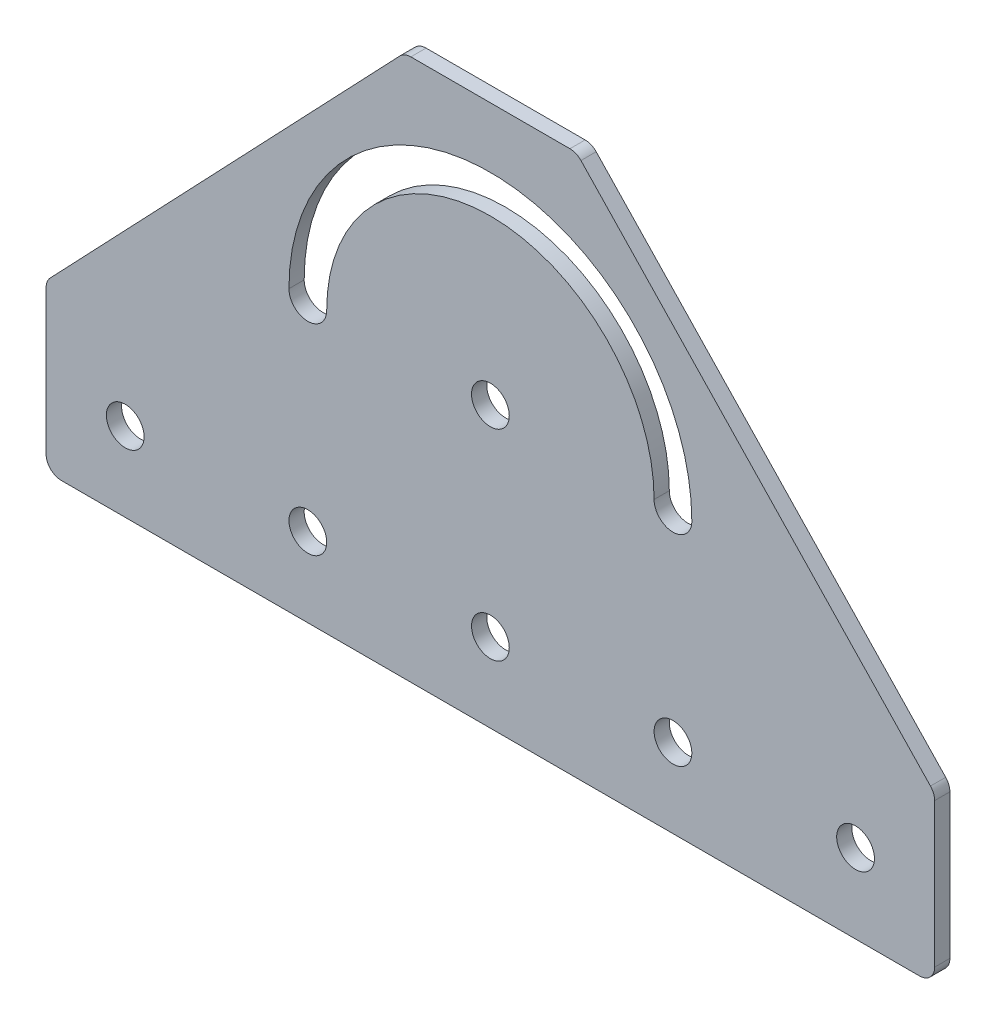
ISO-10303-21;
HEADER;
FILE_DESCRIPTION(('STEP AP214'),'2;1');
FILE_NAME('part.step','',(''),(''),'','','');
FILE_SCHEMA(('AUTOMOTIVE_DESIGN { 1 0 10303 214 1 1 1 1 }'));
ENDSEC;
DATA;
#1=APPLICATION_CONTEXT('core data for automotive mechanical design processes');
#2=APPLICATION_PROTOCOL_DEFINITION('international standard','automotive_design',2000,#1);
#3=PRODUCT_CONTEXT('',#1,'mechanical');
#4=PRODUCT('Part','Part','',(#3));
#5=PRODUCT_RELATED_PRODUCT_CATEGORY('part','',(#4));
#6=PRODUCT_DEFINITION_FORMATION('','',#4);
#7=PRODUCT_DEFINITION_CONTEXT('part definition',#1,'design');
#8=PRODUCT_DEFINITION('design','',#6,#7);
#9=PRODUCT_DEFINITION_SHAPE('','',#8);
#10=(LENGTH_UNIT() NAMED_UNIT(*) SI_UNIT(.MILLI.,.METRE.));
#11=(NAMED_UNIT(*) PLANE_ANGLE_UNIT() SI_UNIT($,.RADIAN.));
#12=(NAMED_UNIT(*) SI_UNIT($,.STERADIAN.) SOLID_ANGLE_UNIT());
#13=UNCERTAINTY_MEASURE_WITH_UNIT(LENGTH_MEASURE(1.E-05),#10,'distance_accuracy_value','');
#14=(GEOMETRIC_REPRESENTATION_CONTEXT(3) GLOBAL_UNCERTAINTY_ASSIGNED_CONTEXT((#13)) GLOBAL_UNIT_ASSIGNED_CONTEXT((#10,
#11,#12)) REPRESENTATION_CONTEXT('',''));
#15=CARTESIAN_POINT('',(0.,0.,0.));
#16=DIRECTION('',(0.,0.,1.));
#17=DIRECTION('',(1.,0.,0.));
#18=AXIS2_PLACEMENT_3D('',#15,#16,#17);
#19=CARTESIAN_POINT('',(0.,0.,2.5));
#20=DIRECTION('',(0.,0.,1.));
#21=DIRECTION('',(1.,0.,0.));
#22=AXIS2_PLACEMENT_3D('',#19,#20,#21);
#23=PLANE('',#22);
#24=CARTESIAN_POINT('',(0.,47.9999999999996,2.5));
#25=DIRECTION('',(0.,0.,1.));
#26=DIRECTION('',(1.,0.,0.));
#27=AXIS2_PLACEMENT_3D('',#24,#25,#26);
#28=CIRCLE('',#27,3.1);
#29=CARTESIAN_POINT('',(3.1,47.9999999999996,2.5));
#30=VERTEX_POINT('',#29);
#31=EDGE_CURVE('E253',#30,#30,#28,.T.);
#32=ORIENTED_EDGE('',*,*,#31,.F.);
#33=EDGE_LOOP('',(#32));
#34=FACE_BOUND('',#33,.T.);
#35=CARTESIAN_POINT('',(-30.,14.9999999999994,2.5));
#36=DIRECTION('',(0.,0.,1.));
#37=DIRECTION('',(1.,0.,0.));
#38=AXIS2_PLACEMENT_3D('',#35,#36,#37);
#39=CIRCLE('',#38,3.1);
#40=CARTESIAN_POINT('',(-26.9,14.9999999999994,2.5));
#41=VERTEX_POINT('',#40);
#42=EDGE_CURVE('E267',#41,#41,#39,.T.);
#43=ORIENTED_EDGE('',*,*,#42,.F.);
#44=EDGE_LOOP('',(#43));
#45=FACE_BOUND('',#44,.T.);
#46=CARTESIAN_POINT('',(30.,14.9999999999999,2.5));
#47=DIRECTION('',(0.,0.,1.));
#48=DIRECTION('',(1.,0.,0.));
#49=AXIS2_PLACEMENT_3D('',#46,#47,#48);
#50=CIRCLE('',#49,3.1);
#51=CARTESIAN_POINT('',(33.1,14.9999999999999,2.5));
#52=VERTEX_POINT('',#51);
#53=EDGE_CURVE('E163',#52,#52,#50,.T.);
#54=ORIENTED_EDGE('',*,*,#53,.F.);
#55=EDGE_LOOP('',(#54));
#56=FACE_BOUND('',#55,.T.);
#57=CARTESIAN_POINT('',(60.,15.,2.5));
#58=DIRECTION('',(0.,0.,1.));
#59=DIRECTION('',(1.,0.,0.));
#60=AXIS2_PLACEMENT_3D('',#57,#58,#59);
#61=CIRCLE('',#60,3.1);
#62=CARTESIAN_POINT('',(63.1,15.,2.5));
#63=VERTEX_POINT('',#62);
#64=EDGE_CURVE('E174',#63,#63,#61,.T.);
#65=ORIENTED_EDGE('',*,*,#64,.F.);
#66=EDGE_LOOP('',(#65));
#67=FACE_BOUND('',#66,.T.);
#68=CARTESIAN_POINT('',(0.,47.9999999999996,2.5));
#69=DIRECTION('',(0.,0.,1.));
#70=DIRECTION('',(1.,0.,0.));
#71=AXIS2_PLACEMENT_3D('',#68,#69,#70);
#72=CIRCLE('',#71,33.1);
#73=CARTESIAN_POINT('',(33.1,47.9999999999996,2.5));
#74=VERTEX_POINT('',#73);
#75=CARTESIAN_POINT('',(-33.1,47.9999999999996,2.5));
#76=VERTEX_POINT('',#75);
#77=EDGE_CURVE('E140',#74,#76,#72,.T.);
#78=ORIENTED_EDGE('',*,*,#77,.F.);
#79=CARTESIAN_POINT('',(30.,47.9999999999996,2.5));
#80=DIRECTION('',(0.,0.,1.));
#81=DIRECTION('',(1.,0.,0.));
#82=AXIS2_PLACEMENT_3D('',#79,#80,#81);
#83=CIRCLE('',#82,3.1);
#84=CARTESIAN_POINT('',(26.9,47.9999999999996,2.5));
#85=VERTEX_POINT('',#84);
#86=EDGE_CURVE('E130',#85,#74,#83,.T.);
#87=ORIENTED_EDGE('',*,*,#86,.F.);
#88=CARTESIAN_POINT('',(0.,47.9999999999996,2.5));
#89=DIRECTION('',(0.,0.,-1.));
#90=DIRECTION('',(1.,0.,0.));
#91=AXIS2_PLACEMENT_3D('',#88,#89,#90);
#92=CIRCLE('',#91,26.9);
#93=CARTESIAN_POINT('',(-26.9,47.9999999999996,2.5));
#94=VERTEX_POINT('',#93);
#95=EDGE_CURVE('E156',#94,#85,#92,.T.);
#96=ORIENTED_EDGE('',*,*,#95,.F.);
#97=CARTESIAN_POINT('',(-30.,47.9999999999996,2.5));
#98=DIRECTION('',(0.,0.,1.));
#99=DIRECTION('',(1.,0.,0.));
#100=AXIS2_PLACEMENT_3D('',#97,#98,#99);
#101=CIRCLE('',#100,3.1);
#102=EDGE_CURVE('E154',#76,#94,#101,.T.);
#103=ORIENTED_EDGE('',*,*,#102,.F.);
#104=EDGE_LOOP('',(#78,#87,#96,#103));
#105=FACE_BOUND('',#104,.T.);
#106=CARTESIAN_POINT('',(0.,14.9999999999996,2.5));
#107=DIRECTION('',(0.,0.,1.));
#108=DIRECTION('',(1.,0.,0.));
#109=AXIS2_PLACEMENT_3D('',#106,#107,#108);
#110=CIRCLE('',#109,3.1);
#111=CARTESIAN_POINT('',(3.1,14.9999999999996,2.5));
#112=VERTEX_POINT('',#111);
#113=EDGE_CURVE('E273',#112,#112,#110,.T.);
#114=ORIENTED_EDGE('',*,*,#113,.F.);
#115=EDGE_LOOP('',(#114));
#116=FACE_BOUND('',#115,.T.);
#117=CARTESIAN_POINT('',(-60.,14.9999999999992,2.5));
#118=DIRECTION('',(0.,0.,1.));
#119=DIRECTION('',(1.,0.,0.));
#120=AXIS2_PLACEMENT_3D('',#117,#118,#119);
#121=CIRCLE('',#120,3.1);
#122=CARTESIAN_POINT('',(-56.9,14.9999999999992,2.5));
#123=VERTEX_POINT('',#122);
#124=EDGE_CURVE('E261',#123,#123,#121,.T.);
#125=ORIENTED_EDGE('',*,*,#124,.F.);
#126=EDGE_LOOP('',(#125));
#127=FACE_BOUND('',#126,.T.);
#128=DIRECTION('',(0.,1.,0.));
#129=VECTOR('',#128,1.);
#130=CARTESIAN_POINT('',(73.,2.00000000000001,2.5));
#131=LINE('',#130,#129);
#132=CARTESIAN_POINT('',(73.,4.50000000000001,2.5));
#133=VERTEX_POINT('',#132);
#134=CARTESIAN_POINT('',(73.,28.2,2.5));
#135=VERTEX_POINT('',#134);
#136=EDGE_CURVE('E243',#133,#135,#131,.T.);
#137=ORIENTED_EDGE('',*,*,#136,.T.);
#138=CARTESIAN_POINT('',(70.5,28.2,2.5));
#139=DIRECTION('',(0.,0.,1.));
#140=DIRECTION('',(1.,0.,0.));
#141=AXIS2_PLACEMENT_3D('',#138,#139,#140);
#142=CIRCLE('',#141,2.5);
#143=CARTESIAN_POINT('',(72.3103448275862,29.9241379310345,2.5));
#144=VERTEX_POINT('',#143);
#145=EDGE_CURVE('E194',#135,#144,#142,.T.);
#146=ORIENTED_EDGE('',*,*,#145,.T.);
#147=DIRECTION('',(-0.689655172413796,0.72413793103448,0.));
#148=VECTOR('',#147,1.);
#149=CARTESIAN_POINT('',(73.,29.2,2.5));
#150=LINE('',#149,#148);
#151=CARTESIAN_POINT('',(14.8817733990148,90.224137931034,2.5));
#152=VERTEX_POINT('',#151);
#153=EDGE_CURVE('E239',#144,#152,#150,.T.);
#154=ORIENTED_EDGE('',*,*,#153,.T.);
#155=CARTESIAN_POINT('',(13.0714285714286,88.4999999999995,2.5));
#156=DIRECTION('',(0.,0.,1.));
#157=DIRECTION('',(1.,0.,0.));
#158=AXIS2_PLACEMENT_3D('',#155,#156,#157);
#159=CIRCLE('',#158,2.5);
#160=CARTESIAN_POINT('',(13.0714285714286,90.9999999999995,2.5));
#161=VERTEX_POINT('',#160);
#162=EDGE_CURVE('E186',#152,#161,#159,.T.);
#163=ORIENTED_EDGE('',*,*,#162,.T.);
#164=DIRECTION('',(-1.,0.,0.));
#165=VECTOR('',#164,1.);
#166=CARTESIAN_POINT('',(14.1428571428571,90.9999999999995,2.5));
#167=LINE('',#166,#165);
#168=CARTESIAN_POINT('',(-13.0714285714286,90.9999999999995,2.5));
#169=VERTEX_POINT('',#168);
#170=EDGE_CURVE('E230',#161,#169,#167,.T.);
#171=ORIENTED_EDGE('',*,*,#170,.T.);
#172=CARTESIAN_POINT('',(-13.0714285714286,88.4999999999995,2.5));
#173=DIRECTION('',(0.,0.,1.));
#174=DIRECTION('',(1.,0.,0.));
#175=AXIS2_PLACEMENT_3D('',#172,#173,#174);
#176=CIRCLE('',#175,2.5);
#177=CARTESIAN_POINT('',(-14.8817733990148,90.224137931034,2.5));
#178=VERTEX_POINT('',#177);
#179=EDGE_CURVE('E184',#169,#178,#176,.T.);
#180=ORIENTED_EDGE('',*,*,#179,.T.);
#181=DIRECTION('',(-0.689655172413796,-0.72413793103448,0.));
#182=VECTOR('',#181,1.);
#183=CARTESIAN_POINT('',(-14.1428571428572,90.9999999999995,2.5));
#184=LINE('',#183,#182);
#185=CARTESIAN_POINT('',(-72.3103448275861,29.9241379310345,2.5));
#186=VERTEX_POINT('',#185);
#187=EDGE_CURVE('E238',#178,#186,#184,.T.);
#188=ORIENTED_EDGE('',*,*,#187,.T.);
#189=CARTESIAN_POINT('',(-70.5,28.2,2.5));
#190=DIRECTION('',(0.,0.,1.));
#191=DIRECTION('',(1.,0.,0.));
#192=AXIS2_PLACEMENT_3D('',#189,#190,#191);
#193=CIRCLE('',#192,2.5);
#194=CARTESIAN_POINT('',(-73.,28.2,2.5));
#195=VERTEX_POINT('',#194);
#196=EDGE_CURVE('E188',#186,#195,#193,.T.);
#197=ORIENTED_EDGE('',*,*,#196,.T.);
#198=DIRECTION('',(0.,-1.,0.));
#199=VECTOR('',#198,1.);
#200=CARTESIAN_POINT('',(-73.,29.2,2.5));
#201=LINE('',#200,#199);
#202=CARTESIAN_POINT('',(-73.,4.5,2.5));
#203=VERTEX_POINT('',#202);
#204=EDGE_CURVE('E241',#195,#203,#201,.T.);
#205=ORIENTED_EDGE('',*,*,#204,.T.);
#206=CARTESIAN_POINT('',(-70.5,4.5,2.5));
#207=DIRECTION('',(0.,0.,1.));
#208=DIRECTION('',(1.,0.,0.));
#209=AXIS2_PLACEMENT_3D('',#206,#207,#208);
#210=CIRCLE('',#209,2.5);
#211=CARTESIAN_POINT('',(-70.5,2.,2.5));
#212=VERTEX_POINT('',#211);
#213=EDGE_CURVE('E190',#203,#212,#210,.T.);
#214=ORIENTED_EDGE('',*,*,#213,.T.);
#215=DIRECTION('',(1.,0.,0.));
#216=VECTOR('',#215,1.);
#217=CARTESIAN_POINT('',(-73.,2.,2.5));
#218=LINE('',#217,#216);
#219=CARTESIAN_POINT('',(70.5,2.00000000000001,2.5));
#220=VERTEX_POINT('',#219);
#221=EDGE_CURVE('E249',#212,#220,#218,.T.);
#222=ORIENTED_EDGE('',*,*,#221,.T.);
#223=CARTESIAN_POINT('',(70.5,4.50000000000001,2.5));
#224=DIRECTION('',(0.,0.,1.));
#225=DIRECTION('',(1.,0.,0.));
#226=AXIS2_PLACEMENT_3D('',#223,#224,#225);
#227=CIRCLE('',#226,2.5);
#228=EDGE_CURVE('E192',#220,#133,#227,.T.);
#229=ORIENTED_EDGE('',*,*,#228,.T.);
#230=EDGE_LOOP('',(#137,#146,#154,#163,#171,#180,#188,#197,#205,#214,#222,#229));
#231=FACE_BOUND('',#230,.T.);
#232=ADVANCED_FACE('F16',(#34,#45,#56,#67,#105,#116,#127,#231),#23,.T.);
#233=CARTESIAN_POINT('',(0.,0.,0.));
#234=DIRECTION('',(0.,0.,1.));
#235=DIRECTION('',(1.,0.,0.));
#236=AXIS2_PLACEMENT_3D('',#233,#234,#235);
#237=PLANE('',#236);
#238=CARTESIAN_POINT('',(0.,47.9999999999996,0.));
#239=DIRECTION('',(0.,0.,1.));
#240=DIRECTION('',(1.,0.,0.));
#241=AXIS2_PLACEMENT_3D('',#238,#239,#240);
#242=CIRCLE('',#241,3.1);
#243=CARTESIAN_POINT('',(3.1,47.9999999999996,0.));
#244=VERTEX_POINT('',#243);
#245=EDGE_CURVE('E257',#244,#244,#242,.T.);
#246=ORIENTED_EDGE('',*,*,#245,.T.);
#247=EDGE_LOOP('',(#246));
#248=FACE_BOUND('',#247,.T.);
#249=CARTESIAN_POINT('',(-60.,14.9999999999992,0.));
#250=DIRECTION('',(0.,0.,1.));
#251=DIRECTION('',(1.,0.,0.));
#252=AXIS2_PLACEMENT_3D('',#249,#250,#251);
#253=CIRCLE('',#252,3.1);
#254=CARTESIAN_POINT('',(-56.9,14.9999999999992,0.));
#255=VERTEX_POINT('',#254);
#256=EDGE_CURVE('E256',#255,#255,#253,.T.);
#257=ORIENTED_EDGE('',*,*,#256,.T.);
#258=EDGE_LOOP('',(#257));
#259=FACE_BOUND('',#258,.T.);
#260=CARTESIAN_POINT('',(-30.,14.9999999999994,0.));
#261=DIRECTION('',(0.,0.,1.));
#262=DIRECTION('',(1.,0.,0.));
#263=AXIS2_PLACEMENT_3D('',#260,#261,#262);
#264=CIRCLE('',#263,3.1);
#265=CARTESIAN_POINT('',(-26.9,14.9999999999994,0.));
#266=VERTEX_POINT('',#265);
#267=EDGE_CURVE('E264',#266,#266,#264,.T.);
#268=ORIENTED_EDGE('',*,*,#267,.T.);
#269=EDGE_LOOP('',(#268));
#270=FACE_BOUND('',#269,.T.);
#271=CARTESIAN_POINT('',(0.,14.9999999999996,0.));
#272=DIRECTION('',(0.,0.,1.));
#273=DIRECTION('',(1.,0.,0.));
#274=AXIS2_PLACEMENT_3D('',#271,#272,#273);
#275=CIRCLE('',#274,3.1);
#276=CARTESIAN_POINT('',(3.1,14.9999999999996,0.));
#277=VERTEX_POINT('',#276);
#278=EDGE_CURVE('E270',#277,#277,#275,.T.);
#279=ORIENTED_EDGE('',*,*,#278,.T.);
#280=EDGE_LOOP('',(#279));
#281=FACE_BOUND('',#280,.T.);
#282=CARTESIAN_POINT('',(30.,14.9999999999999,0.));
#283=DIRECTION('',(0.,0.,1.));
#284=DIRECTION('',(1.,0.,0.));
#285=AXIS2_PLACEMENT_3D('',#282,#283,#284);
#286=CIRCLE('',#285,3.1);
#287=CARTESIAN_POINT('',(33.1,14.9999999999999,0.));
#288=VERTEX_POINT('',#287);
#289=EDGE_CURVE('E276',#288,#288,#286,.T.);
#290=ORIENTED_EDGE('',*,*,#289,.T.);
#291=EDGE_LOOP('',(#290));
#292=FACE_BOUND('',#291,.T.);
#293=CARTESIAN_POINT('',(30.,47.9999999999996,0.));
#294=DIRECTION('',(0.,0.,1.));
#295=DIRECTION('',(1.,0.,0.));
#296=AXIS2_PLACEMENT_3D('',#293,#294,#295);
#297=CIRCLE('',#296,3.1);
#298=CARTESIAN_POINT('',(26.9,47.9999999999996,0.));
#299=VERTEX_POINT('',#298);
#300=CARTESIAN_POINT('',(33.1,47.9999999999996,0.));
#301=VERTEX_POINT('',#300);
#302=EDGE_CURVE('E161',#299,#301,#297,.T.);
#303=ORIENTED_EDGE('',*,*,#302,.T.);
#304=CARTESIAN_POINT('',(0.,47.9999999999996,0.));
#305=DIRECTION('',(0.,0.,1.));
#306=DIRECTION('',(1.,0.,0.));
#307=AXIS2_PLACEMENT_3D('',#304,#305,#306);
#308=CIRCLE('',#307,33.1);
#309=CARTESIAN_POINT('',(-33.1,47.9999999999996,0.));
#310=VERTEX_POINT('',#309);
#311=EDGE_CURVE('E147',#301,#310,#308,.T.);
#312=ORIENTED_EDGE('',*,*,#311,.T.);
#313=CARTESIAN_POINT('',(-30.,47.9999999999996,0.));
#314=DIRECTION('',(0.,0.,1.));
#315=DIRECTION('',(1.,0.,0.));
#316=AXIS2_PLACEMENT_3D('',#313,#314,#315);
#317=CIRCLE('',#316,3.1);
#318=CARTESIAN_POINT('',(-26.9,47.9999999999996,0.));
#319=VERTEX_POINT('',#318);
#320=EDGE_CURVE('E165',#310,#319,#317,.T.);
#321=ORIENTED_EDGE('',*,*,#320,.T.);
#322=CARTESIAN_POINT('',(0.,47.9999999999996,0.));
#323=DIRECTION('',(0.,0.,-1.));
#324=DIRECTION('',(1.,0.,0.));
#325=AXIS2_PLACEMENT_3D('',#322,#323,#324);
#326=CIRCLE('',#325,26.9);
#327=EDGE_CURVE('E141',#319,#299,#326,.T.);
#328=ORIENTED_EDGE('',*,*,#327,.T.);
#329=EDGE_LOOP('',(#303,#312,#321,#328));
#330=FACE_BOUND('',#329,.T.);
#331=CARTESIAN_POINT('',(60.,15.,0.));
#332=DIRECTION('',(0.,0.,1.));
#333=DIRECTION('',(1.,0.,0.));
#334=AXIS2_PLACEMENT_3D('',#331,#332,#333);
#335=CIRCLE('',#334,3.1);
#336=CARTESIAN_POINT('',(63.1,15.,0.));
#337=VERTEX_POINT('',#336);
#338=EDGE_CURVE('E148',#337,#337,#335,.T.);
#339=ORIENTED_EDGE('',*,*,#338,.T.);
#340=EDGE_LOOP('',(#339));
#341=FACE_BOUND('',#340,.T.);
#342=DIRECTION('',(-0.689655172413796,0.72413793103448,0.));
#343=VECTOR('',#342,1.);
#344=CARTESIAN_POINT('',(73.,29.2,0.));
#345=LINE('',#344,#343);
#346=CARTESIAN_POINT('',(72.3103448275862,29.9241379310345,0.));
#347=VERTEX_POINT('',#346);
#348=CARTESIAN_POINT('',(14.8817733990148,90.224137931034,0.));
#349=VERTEX_POINT('',#348);
#350=EDGE_CURVE('E343',#347,#349,#345,.T.);
#351=ORIENTED_EDGE('',*,*,#350,.F.);
#352=CARTESIAN_POINT('',(70.5,28.2,0.));
#353=DIRECTION('',(0.,0.,1.));
#354=DIRECTION('',(1.,0.,0.));
#355=AXIS2_PLACEMENT_3D('',#352,#353,#354);
#356=CIRCLE('',#355,2.5);
#357=CARTESIAN_POINT('',(73.,28.2,0.));
#358=VERTEX_POINT('',#357);
#359=EDGE_CURVE('E210',#347,#358,#356,.F.);
#360=ORIENTED_EDGE('',*,*,#359,.T.);
#361=DIRECTION('',(0.,1.,0.));
#362=VECTOR('',#361,1.);
#363=CARTESIAN_POINT('',(73.,2.00000000000001,0.));
#364=LINE('',#363,#362);
#365=CARTESIAN_POINT('',(73.,4.50000000000001,0.));
#366=VERTEX_POINT('',#365);
#367=EDGE_CURVE('E252',#366,#358,#364,.T.);
#368=ORIENTED_EDGE('',*,*,#367,.F.);
#369=CARTESIAN_POINT('',(70.5,4.50000000000001,0.));
#370=DIRECTION('',(0.,0.,1.));
#371=DIRECTION('',(1.,0.,0.));
#372=AXIS2_PLACEMENT_3D('',#369,#370,#371);
#373=CIRCLE('',#372,2.5);
#374=CARTESIAN_POINT('',(70.5,2.00000000000001,0.));
#375=VERTEX_POINT('',#374);
#376=EDGE_CURVE('E208',#366,#375,#373,.F.);
#377=ORIENTED_EDGE('',*,*,#376,.T.);
#378=DIRECTION('',(1.,0.,0.));
#379=VECTOR('',#378,1.);
#380=CARTESIAN_POINT('',(-73.,2.,0.));
#381=LINE('',#380,#379);
#382=CARTESIAN_POINT('',(-70.5,2.,0.));
#383=VERTEX_POINT('',#382);
#384=EDGE_CURVE('E260',#383,#375,#381,.T.);
#385=ORIENTED_EDGE('',*,*,#384,.F.);
#386=CARTESIAN_POINT('',(-70.5,4.5,0.));
#387=DIRECTION('',(0.,0.,1.));
#388=DIRECTION('',(1.,0.,0.));
#389=AXIS2_PLACEMENT_3D('',#386,#387,#388);
#390=CIRCLE('',#389,2.5);
#391=CARTESIAN_POINT('',(-73.,4.5,0.));
#392=VERTEX_POINT('',#391);
#393=EDGE_CURVE('E206',#383,#392,#390,.F.);
#394=ORIENTED_EDGE('',*,*,#393,.T.);
#395=DIRECTION('',(0.,-1.,0.));
#396=VECTOR('',#395,1.);
#397=CARTESIAN_POINT('',(-73.,29.2,0.));
#398=LINE('',#397,#396);
#399=CARTESIAN_POINT('',(-73.,28.2,0.));
#400=VERTEX_POINT('',#399);
#401=EDGE_CURVE('E356',#400,#392,#398,.T.);
#402=ORIENTED_EDGE('',*,*,#401,.F.);
#403=CARTESIAN_POINT('',(-70.5,28.2,0.));
#404=DIRECTION('',(0.,0.,1.));
#405=DIRECTION('',(1.,0.,0.));
#406=AXIS2_PLACEMENT_3D('',#403,#404,#405);
#407=CIRCLE('',#406,2.5);
#408=CARTESIAN_POINT('',(-72.3103448275861,29.9241379310345,0.));
#409=VERTEX_POINT('',#408);
#410=EDGE_CURVE('E204',#400,#409,#407,.F.);
#411=ORIENTED_EDGE('',*,*,#410,.T.);
#412=DIRECTION('',(-0.689655172413796,-0.72413793103448,0.));
#413=VECTOR('',#412,1.);
#414=CARTESIAN_POINT('',(-14.1428571428572,90.9999999999995,0.));
#415=LINE('',#414,#413);
#416=CARTESIAN_POINT('',(-14.8817733990148,90.224137931034,0.));
#417=VERTEX_POINT('',#416);
#418=EDGE_CURVE('E349',#417,#409,#415,.T.);
#419=ORIENTED_EDGE('',*,*,#418,.F.);
#420=CARTESIAN_POINT('',(-13.0714285714286,88.4999999999995,0.));
#421=DIRECTION('',(0.,0.,1.));
#422=DIRECTION('',(1.,0.,0.));
#423=AXIS2_PLACEMENT_3D('',#420,#421,#422);
#424=CIRCLE('',#423,2.5);
#425=CARTESIAN_POINT('',(-13.0714285714286,90.9999999999995,0.));
#426=VERTEX_POINT('',#425);
#427=EDGE_CURVE('E31',#417,#426,#424,.F.);
#428=ORIENTED_EDGE('',*,*,#427,.T.);
#429=DIRECTION('',(-1.,0.,0.));
#430=VECTOR('',#429,1.);
#431=CARTESIAN_POINT('',(14.1428571428571,90.9999999999995,0.));
#432=LINE('',#431,#430);
#433=CARTESIAN_POINT('',(13.0714285714286,90.9999999999995,0.));
#434=VERTEX_POINT('',#433);
#435=EDGE_CURVE('E231',#434,#426,#432,.T.);
#436=ORIENTED_EDGE('',*,*,#435,.F.);
#437=CARTESIAN_POINT('',(13.0714285714286,88.4999999999995,0.));
#438=DIRECTION('',(0.,0.,1.));
#439=DIRECTION('',(1.,0.,0.));
#440=AXIS2_PLACEMENT_3D('',#437,#438,#439);
#441=CIRCLE('',#440,2.5);
#442=EDGE_CURVE('E202',#434,#349,#441,.F.);
#443=ORIENTED_EDGE('',*,*,#442,.T.);
#444=EDGE_LOOP('',(#351,#360,#368,#377,#385,#394,#402,#411,#419,#428,#436,#443));
#445=FACE_BOUND('',#444,.T.);
#446=ADVANCED_FACE('F283',(#248,#259,#270,#281,#292,#330,#341,#445),#237,.F.);
#447=CARTESIAN_POINT('',(60.,15.,2.5));
#448=DIRECTION('',(0.,0.,-1.));
#449=DIRECTION('',(-1.,0.,0.));
#450=AXIS2_PLACEMENT_3D('',#447,#448,#449);
#451=CYLINDRICAL_SURFACE('',#450,3.1);
#452=ORIENTED_EDGE('',*,*,#64,.T.);
#453=EDGE_LOOP('',(#452));
#454=FACE_BOUND('',#453,.T.);
#455=ORIENTED_EDGE('',*,*,#338,.F.);
#456=EDGE_LOOP('',(#455));
#457=FACE_BOUND('',#456,.T.);
#458=ADVANCED_FACE('F309',(#454,#457),#451,.F.);
#459=CARTESIAN_POINT('',(30.,47.9999999999996,2.5));
#460=DIRECTION('',(0.,0.,-1.));
#461=DIRECTION('',(-1.,0.,0.));
#462=AXIS2_PLACEMENT_3D('',#459,#460,#461);
#463=CYLINDRICAL_SURFACE('',#462,3.1);
#464=ORIENTED_EDGE('',*,*,#302,.F.);
#465=DIRECTION('',(0.,0.,-1.));
#466=VECTOR('',#465,1.);
#467=CARTESIAN_POINT('',(26.9,47.9999999999996,2.5));
#468=LINE('',#467,#466);
#469=EDGE_CURVE('E136',#85,#299,#468,.T.);
#470=ORIENTED_EDGE('',*,*,#469,.F.);
#471=ORIENTED_EDGE('',*,*,#86,.T.);
#472=DIRECTION('',(0.,0.,-1.));
#473=VECTOR('',#472,1.);
#474=CARTESIAN_POINT('',(33.1,47.9999999999996,2.5));
#475=LINE('',#474,#473);
#476=EDGE_CURVE('E133',#74,#301,#475,.T.);
#477=ORIENTED_EDGE('',*,*,#476,.T.);
#478=EDGE_LOOP('',(#464,#470,#471,#477));
#479=FACE_BOUND('',#478,.T.);
#480=ADVANCED_FACE('F132',(#479),#463,.F.);
#481=CARTESIAN_POINT('',(0.,47.9999999999996,2.5));
#482=DIRECTION('',(0.,0.,-1.));
#483=DIRECTION('',(-1.,0.,0.));
#484=AXIS2_PLACEMENT_3D('',#481,#482,#483);
#485=CYLINDRICAL_SURFACE('',#484,33.1);
#486=ORIENTED_EDGE('',*,*,#311,.F.);
#487=ORIENTED_EDGE('',*,*,#476,.F.);
#488=ORIENTED_EDGE('',*,*,#77,.T.);
#489=DIRECTION('',(0.,0.,-1.));
#490=VECTOR('',#489,1.);
#491=CARTESIAN_POINT('',(-33.1,47.9999999999996,2.5));
#492=LINE('',#491,#490);
#493=EDGE_CURVE('E149',#76,#310,#492,.T.);
#494=ORIENTED_EDGE('',*,*,#493,.T.);
#495=EDGE_LOOP('',(#486,#487,#488,#494));
#496=FACE_BOUND('',#495,.T.);
#497=ADVANCED_FACE('F144',(#496),#485,.F.);
#498=CARTESIAN_POINT('',(-30.,47.9999999999996,2.5));
#499=DIRECTION('',(0.,0.,-1.));
#500=DIRECTION('',(-1.,0.,0.));
#501=AXIS2_PLACEMENT_3D('',#498,#499,#500);
#502=CYLINDRICAL_SURFACE('',#501,3.1);
#503=ORIENTED_EDGE('',*,*,#320,.F.);
#504=ORIENTED_EDGE('',*,*,#493,.F.);
#505=ORIENTED_EDGE('',*,*,#102,.T.);
#506=DIRECTION('',(0.,0.,-1.));
#507=VECTOR('',#506,1.);
#508=CARTESIAN_POINT('',(-26.9,47.9999999999996,2.5));
#509=LINE('',#508,#507);
#510=EDGE_CURVE('E171',#94,#319,#509,.T.);
#511=ORIENTED_EDGE('',*,*,#510,.T.);
#512=EDGE_LOOP('',(#503,#504,#505,#511));
#513=FACE_BOUND('',#512,.T.);
#514=ADVANCED_FACE('F300',(#513),#502,.F.);
#515=CARTESIAN_POINT('',(0.,47.9999999999996,2.5));
#516=DIRECTION('',(0.,0.,-1.));
#517=DIRECTION('',(-1.,0.,0.));
#518=AXIS2_PLACEMENT_3D('',#515,#516,#517);
#519=CYLINDRICAL_SURFACE('',#518,26.9);
#520=ORIENTED_EDGE('',*,*,#327,.F.);
#521=ORIENTED_EDGE('',*,*,#510,.F.);
#522=ORIENTED_EDGE('',*,*,#95,.T.);
#523=ORIENTED_EDGE('',*,*,#469,.T.);
#524=EDGE_LOOP('',(#520,#521,#522,#523));
#525=FACE_BOUND('',#524,.T.);
#526=ADVANCED_FACE('F289',(#525),#519,.T.);
#527=CARTESIAN_POINT('',(30.,14.9999999999999,2.5));
#528=DIRECTION('',(0.,0.,-1.));
#529=DIRECTION('',(-1.,0.,0.));
#530=AXIS2_PLACEMENT_3D('',#527,#528,#529);
#531=CYLINDRICAL_SURFACE('',#530,3.1);
#532=ORIENTED_EDGE('',*,*,#53,.T.);
#533=EDGE_LOOP('',(#532));
#534=FACE_BOUND('',#533,.T.);
#535=ORIENTED_EDGE('',*,*,#289,.F.);
#536=EDGE_LOOP('',(#535));
#537=FACE_BOUND('',#536,.T.);
#538=ADVANCED_FACE('F286',(#534,#537),#531,.F.);
#539=CARTESIAN_POINT('',(0.,14.9999999999996,2.5));
#540=DIRECTION('',(0.,0.,-1.));
#541=DIRECTION('',(-1.,0.,0.));
#542=AXIS2_PLACEMENT_3D('',#539,#540,#541);
#543=CYLINDRICAL_SURFACE('',#542,3.1);
#544=ORIENTED_EDGE('',*,*,#113,.T.);
#545=EDGE_LOOP('',(#544));
#546=FACE_BOUND('',#545,.T.);
#547=ORIENTED_EDGE('',*,*,#278,.F.);
#548=EDGE_LOOP('',(#547));
#549=FACE_BOUND('',#548,.T.);
#550=ADVANCED_FACE('F288',(#546,#549),#543,.F.);
#551=CARTESIAN_POINT('',(-30.,14.9999999999994,2.5));
#552=DIRECTION('',(0.,0.,-1.));
#553=DIRECTION('',(-1.,0.,0.));
#554=AXIS2_PLACEMENT_3D('',#551,#552,#553);
#555=CYLINDRICAL_SURFACE('',#554,3.1);
#556=ORIENTED_EDGE('',*,*,#42,.T.);
#557=EDGE_LOOP('',(#556));
#558=FACE_BOUND('',#557,.T.);
#559=ORIENTED_EDGE('',*,*,#267,.F.);
#560=EDGE_LOOP('',(#559));
#561=FACE_BOUND('',#560,.T.);
#562=ADVANCED_FACE('F297',(#558,#561),#555,.F.);
#563=CARTESIAN_POINT('',(-60.,14.9999999999992,2.5));
#564=DIRECTION('',(0.,0.,-1.));
#565=DIRECTION('',(-1.,0.,0.));
#566=AXIS2_PLACEMENT_3D('',#563,#564,#565);
#567=CYLINDRICAL_SURFACE('',#566,3.1);
#568=ORIENTED_EDGE('',*,*,#124,.T.);
#569=EDGE_LOOP('',(#568));
#570=FACE_BOUND('',#569,.T.);
#571=ORIENTED_EDGE('',*,*,#256,.F.);
#572=EDGE_LOOP('',(#571));
#573=FACE_BOUND('',#572,.T.);
#574=ADVANCED_FACE('F402',(#570,#573),#567,.F.);
#575=CARTESIAN_POINT('',(0.,47.9999999999996,2.5));
#576=DIRECTION('',(0.,0.,-1.));
#577=DIRECTION('',(-1.,0.,0.));
#578=AXIS2_PLACEMENT_3D('',#575,#576,#577);
#579=CYLINDRICAL_SURFACE('',#578,3.1);
#580=ORIENTED_EDGE('',*,*,#31,.T.);
#581=EDGE_LOOP('',(#580));
#582=FACE_BOUND('',#581,.T.);
#583=ORIENTED_EDGE('',*,*,#245,.F.);
#584=EDGE_LOOP('',(#583));
#585=FACE_BOUND('',#584,.T.);
#586=ADVANCED_FACE('F399',(#582,#585),#579,.F.);
#587=CARTESIAN_POINT('',(73.,2.00000000000001,0.));
#588=DIRECTION('',(1.,0.,0.));
#589=DIRECTION('',(0.,0.,-1.));
#590=AXIS2_PLACEMENT_3D('',#587,#588,#589);
#591=PLANE('',#590);
#592=ORIENTED_EDGE('',*,*,#367,.T.);
#593=DIRECTION('',(0.,0.,1.));
#594=VECTOR('',#593,1.);
#595=CARTESIAN_POINT('',(73.,28.2,0.));
#596=LINE('',#595,#594);
#597=EDGE_CURVE('E181',#358,#135,#596,.T.);
#598=ORIENTED_EDGE('',*,*,#597,.T.);
#599=ORIENTED_EDGE('',*,*,#136,.F.);
#600=DIRECTION('',(0.,0.,1.));
#601=VECTOR('',#600,1.);
#602=CARTESIAN_POINT('',(73.,4.50000000000001,0.));
#603=LINE('',#602,#601);
#604=EDGE_CURVE('E177',#133,#366,#603,.F.);
#605=ORIENTED_EDGE('',*,*,#604,.T.);
#606=EDGE_LOOP('',(#592,#598,#599,#605));
#607=FACE_BOUND('',#606,.T.);
#608=ADVANCED_FACE('F363',(#607),#591,.T.);
#609=CARTESIAN_POINT('',(-73.,2.,0.));
#610=DIRECTION('',(0.,-1.,0.));
#611=DIRECTION('',(1.,0.,0.));
#612=AXIS2_PLACEMENT_3D('',#609,#610,#611);
#613=PLANE('',#612);
#614=ORIENTED_EDGE('',*,*,#384,.T.);
#615=DIRECTION('',(0.,0.,1.));
#616=VECTOR('',#615,1.);
#617=CARTESIAN_POINT('',(70.5,2.00000000000001,0.));
#618=LINE('',#617,#616);
#619=EDGE_CURVE('E214',#375,#220,#618,.T.);
#620=ORIENTED_EDGE('',*,*,#619,.T.);
#621=ORIENTED_EDGE('',*,*,#221,.F.);
#622=DIRECTION('',(0.,0.,1.));
#623=VECTOR('',#622,1.);
#624=CARTESIAN_POINT('',(-70.5,2.,0.));
#625=LINE('',#624,#623);
#626=EDGE_CURVE('E212',#212,#383,#625,.F.);
#627=ORIENTED_EDGE('',*,*,#626,.T.);
#628=EDGE_LOOP('',(#614,#620,#621,#627));
#629=FACE_BOUND('',#628,.T.);
#630=ADVANCED_FACE('F371',(#629),#613,.T.);
#631=CARTESIAN_POINT('',(-73.,29.2,0.));
#632=DIRECTION('',(-1.,0.,0.));
#633=DIRECTION('',(0.,0.,1.));
#634=AXIS2_PLACEMENT_3D('',#631,#632,#633);
#635=PLANE('',#634);
#636=ORIENTED_EDGE('',*,*,#401,.T.);
#637=DIRECTION('',(0.,0.,1.));
#638=VECTOR('',#637,1.);
#639=CARTESIAN_POINT('',(-73.,4.5,0.));
#640=LINE('',#639,#638);
#641=EDGE_CURVE('E219',#392,#203,#640,.T.);
#642=ORIENTED_EDGE('',*,*,#641,.T.);
#643=ORIENTED_EDGE('',*,*,#204,.F.);
#644=DIRECTION('',(0.,0.,1.));
#645=VECTOR('',#644,1.);
#646=CARTESIAN_POINT('',(-73.,28.2,0.));
#647=LINE('',#646,#645);
#648=EDGE_CURVE('E217',#195,#400,#647,.F.);
#649=ORIENTED_EDGE('',*,*,#648,.T.);
#650=EDGE_LOOP('',(#636,#642,#643,#649));
#651=FACE_BOUND('',#650,.T.);
#652=ADVANCED_FACE('F378',(#651),#635,.T.);
#653=CARTESIAN_POINT('',(-14.1428571428572,90.9999999999995,0.));
#654=DIRECTION('',(-0.72413793103448,0.689655172413796,0.));
#655=DIRECTION('',(-0.689655172413796,-0.72413793103448,0.));
#656=AXIS2_PLACEMENT_3D('',#653,#654,#655);
#657=PLANE('',#656);
#658=ORIENTED_EDGE('',*,*,#418,.T.);
#659=DIRECTION('',(0.,0.,1.));
#660=VECTOR('',#659,1.);
#661=CARTESIAN_POINT('',(-72.3103448275862,29.9241379310345,0.));
#662=LINE('',#661,#660);
#663=EDGE_CURVE('E224',#409,#186,#662,.T.);
#664=ORIENTED_EDGE('',*,*,#663,.T.);
#665=ORIENTED_EDGE('',*,*,#187,.F.);
#666=DIRECTION('',(0.,0.,1.));
#667=VECTOR('',#666,1.);
#668=CARTESIAN_POINT('',(-14.8817733990148,90.224137931034,0.));
#669=LINE('',#668,#667);
#670=EDGE_CURVE('E222',#178,#417,#669,.F.);
#671=ORIENTED_EDGE('',*,*,#670,.T.);
#672=EDGE_LOOP('',(#658,#664,#665,#671));
#673=FACE_BOUND('',#672,.T.);
#674=ADVANCED_FACE('F383',(#673),#657,.T.);
#675=CARTESIAN_POINT('',(14.1428571428571,90.9999999999995,0.));
#676=DIRECTION('',(0.,1.,0.));
#677=DIRECTION('',(0.,0.,1.));
#678=AXIS2_PLACEMENT_3D('',#675,#676,#677);
#679=PLANE('',#678);
#680=ORIENTED_EDGE('',*,*,#170,.F.);
#681=DIRECTION('',(0.,0.,1.));
#682=VECTOR('',#681,1.);
#683=CARTESIAN_POINT('',(13.0714285714286,90.9999999999995,0.));
#684=LINE('',#683,#682);
#685=EDGE_CURVE('E10',#161,#434,#684,.F.);
#686=ORIENTED_EDGE('',*,*,#685,.T.);
#687=ORIENTED_EDGE('',*,*,#435,.T.);
#688=DIRECTION('',(0.,0.,1.));
#689=VECTOR('',#688,1.);
#690=CARTESIAN_POINT('',(-13.0714285714286,90.9999999999995,0.));
#691=LINE('',#690,#689);
#692=EDGE_CURVE('E24',#426,#169,#691,.T.);
#693=ORIENTED_EDGE('',*,*,#692,.T.);
#694=EDGE_LOOP('',(#680,#686,#687,#693));
#695=FACE_BOUND('',#694,.T.);
#696=ADVANCED_FACE('F229',(#695),#679,.T.);
#697=CARTESIAN_POINT('',(73.,29.2,0.));
#698=DIRECTION('',(0.72413793103448,0.689655172413796,0.));
#699=DIRECTION('',(-0.689655172413796,0.72413793103448,0.));
#700=AXIS2_PLACEMENT_3D('',#697,#698,#699);
#701=PLANE('',#700);
#702=ORIENTED_EDGE('',*,*,#153,.F.);
#703=DIRECTION('',(0.,0.,1.));
#704=VECTOR('',#703,1.);
#705=CARTESIAN_POINT('',(72.3103448275862,29.9241379310345,0.));
#706=LINE('',#705,#704);
#707=EDGE_CURVE('E199',#144,#347,#706,.F.);
#708=ORIENTED_EDGE('',*,*,#707,.T.);
#709=ORIENTED_EDGE('',*,*,#350,.T.);
#710=DIRECTION('',(0.,0.,1.));
#711=VECTOR('',#710,1.);
#712=CARTESIAN_POINT('',(14.8817733990148,90.224137931034,0.));
#713=LINE('',#712,#711);
#714=EDGE_CURVE('E196',#349,#152,#713,.T.);
#715=ORIENTED_EDGE('',*,*,#714,.T.);
#716=EDGE_LOOP('',(#702,#708,#709,#715));
#717=FACE_BOUND('',#716,.T.);
#718=ADVANCED_FACE('F321',(#717),#701,.T.);
#719=CARTESIAN_POINT('',(70.5,28.2,0.));
#720=DIRECTION('',(0.,0.,1.));
#721=DIRECTION('',(1.,0.,0.));
#722=AXIS2_PLACEMENT_3D('',#719,#720,#721);
#723=CYLINDRICAL_SURFACE('',#722,2.5);
#724=ORIENTED_EDGE('',*,*,#359,.F.);
#725=ORIENTED_EDGE('',*,*,#707,.F.);
#726=ORIENTED_EDGE('',*,*,#145,.F.);
#727=ORIENTED_EDGE('',*,*,#597,.F.);
#728=EDGE_LOOP('',(#724,#725,#726,#727));
#729=FACE_BOUND('',#728,.T.);
#730=ADVANCED_FACE('F317',(#729),#723,.T.);
#731=CARTESIAN_POINT('',(70.5,4.50000000000001,0.));
#732=DIRECTION('',(0.,0.,1.));
#733=DIRECTION('',(1.,0.,0.));
#734=AXIS2_PLACEMENT_3D('',#731,#732,#733);
#735=CYLINDRICAL_SURFACE('',#734,2.5);
#736=ORIENTED_EDGE('',*,*,#376,.F.);
#737=ORIENTED_EDGE('',*,*,#604,.F.);
#738=ORIENTED_EDGE('',*,*,#228,.F.);
#739=ORIENTED_EDGE('',*,*,#619,.F.);
#740=EDGE_LOOP('',(#736,#737,#738,#739));
#741=FACE_BOUND('',#740,.T.);
#742=ADVANCED_FACE('F320',(#741),#735,.T.);
#743=CARTESIAN_POINT('',(-70.5,4.5,0.));
#744=DIRECTION('',(0.,0.,1.));
#745=DIRECTION('',(1.,0.,0.));
#746=AXIS2_PLACEMENT_3D('',#743,#744,#745);
#747=CYLINDRICAL_SURFACE('',#746,2.5);
#748=ORIENTED_EDGE('',*,*,#393,.F.);
#749=ORIENTED_EDGE('',*,*,#626,.F.);
#750=ORIENTED_EDGE('',*,*,#213,.F.);
#751=ORIENTED_EDGE('',*,*,#641,.F.);
#752=EDGE_LOOP('',(#748,#749,#750,#751));
#753=FACE_BOUND('',#752,.T.);
#754=ADVANCED_FACE('F325',(#753),#747,.T.);
#755=CARTESIAN_POINT('',(-70.5,28.2,0.));
#756=DIRECTION('',(0.,0.,1.));
#757=DIRECTION('',(1.,0.,0.));
#758=AXIS2_PLACEMENT_3D('',#755,#756,#757);
#759=CYLINDRICAL_SURFACE('',#758,2.5);
#760=ORIENTED_EDGE('',*,*,#410,.F.);
#761=ORIENTED_EDGE('',*,*,#648,.F.);
#762=ORIENTED_EDGE('',*,*,#196,.F.);
#763=ORIENTED_EDGE('',*,*,#663,.F.);
#764=EDGE_LOOP('',(#760,#761,#762,#763));
#765=FACE_BOUND('',#764,.T.);
#766=ADVANCED_FACE('F329',(#765),#759,.T.);
#767=CARTESIAN_POINT('',(13.0714285714286,88.4999999999995,0.));
#768=DIRECTION('',(0.,0.,1.));
#769=DIRECTION('',(1.,0.,0.));
#770=AXIS2_PLACEMENT_3D('',#767,#768,#769);
#771=CYLINDRICAL_SURFACE('',#770,2.5);
#772=ORIENTED_EDGE('',*,*,#442,.F.);
#773=ORIENTED_EDGE('',*,*,#685,.F.);
#774=ORIENTED_EDGE('',*,*,#162,.F.);
#775=ORIENTED_EDGE('',*,*,#714,.F.);
#776=EDGE_LOOP('',(#772,#773,#774,#775));
#777=FACE_BOUND('',#776,.T.);
#778=ADVANCED_FACE('F332',(#777),#771,.T.);
#779=CARTESIAN_POINT('',(-13.0714285714286,88.4999999999995,0.));
#780=DIRECTION('',(0.,0.,1.));
#781=DIRECTION('',(1.,0.,0.));
#782=AXIS2_PLACEMENT_3D('',#779,#780,#781);
#783=CYLINDRICAL_SURFACE('',#782,2.5);
#784=ORIENTED_EDGE('',*,*,#427,.F.);
#785=ORIENTED_EDGE('',*,*,#670,.F.);
#786=ORIENTED_EDGE('',*,*,#179,.F.);
#787=ORIENTED_EDGE('',*,*,#692,.F.);
#788=EDGE_LOOP('',(#784,#785,#786,#787));
#789=FACE_BOUND('',#788,.T.);
#790=ADVANCED_FACE('F18',(#789),#783,.T.);
#791=CLOSED_SHELL('',(#232,#446,#458,#480,#497,#514,#526,#538,#550,#562,#574,#586,#608,#630,
#652,#674,#696,#718,#730,#742,#754,#766,#778,#790));
#792=MANIFOLD_SOLID_BREP('B1',#791);
#793=ADVANCED_BREP_SHAPE_REPRESENTATION('',(#18,#792),#14);
#794=SHAPE_DEFINITION_REPRESENTATION(#9,#793);
ENDSEC;
END-ISO-10303-21;
